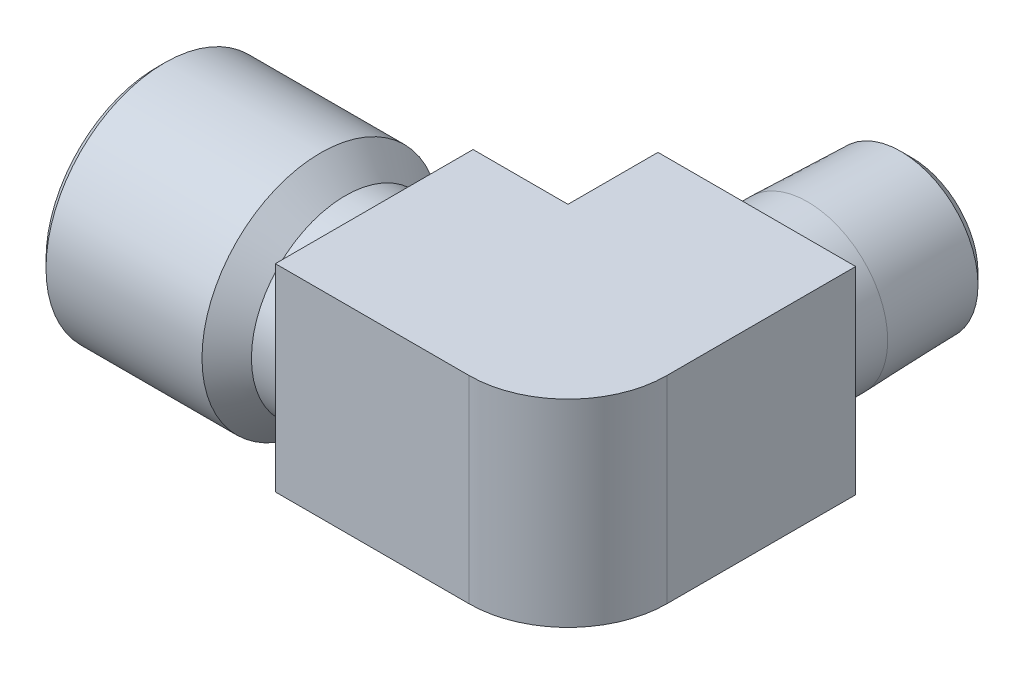
ISO-10303-21;
HEADER;
FILE_DESCRIPTION(('STEP AP214'),'2;1');
FILE_NAME('part.step','',(''),(''),'','','');
FILE_SCHEMA(('AUTOMOTIVE_DESIGN { 1 0 10303 214 1 1 1 1 }'));
ENDSEC;
DATA;
#1=APPLICATION_CONTEXT('core data for automotive mechanical design processes');
#2=APPLICATION_PROTOCOL_DEFINITION('international standard','automotive_design',2000,#1);
#3=PRODUCT_CONTEXT('',#1,'mechanical');
#4=PRODUCT('Part','Part','',(#3));
#5=PRODUCT_RELATED_PRODUCT_CATEGORY('part','',(#4));
#6=PRODUCT_DEFINITION_FORMATION('','',#4);
#7=PRODUCT_DEFINITION_CONTEXT('part definition',#1,'design');
#8=PRODUCT_DEFINITION('design','',#6,#7);
#9=PRODUCT_DEFINITION_SHAPE('','',#8);
#10=(LENGTH_UNIT() NAMED_UNIT(*) SI_UNIT(.MILLI.,.METRE.));
#11=(NAMED_UNIT(*) PLANE_ANGLE_UNIT() SI_UNIT($,.RADIAN.));
#12=(NAMED_UNIT(*) SI_UNIT($,.STERADIAN.) SOLID_ANGLE_UNIT());
#13=UNCERTAINTY_MEASURE_WITH_UNIT(LENGTH_MEASURE(1.E-05),#10,'distance_accuracy_value','');
#14=(GEOMETRIC_REPRESENTATION_CONTEXT(3) GLOBAL_UNCERTAINTY_ASSIGNED_CONTEXT((#13)) GLOBAL_UNIT_ASSIGNED_CONTEXT((#10,
#11,#12)) REPRESENTATION_CONTEXT('',''));
#15=CARTESIAN_POINT('',(0.,0.,0.));
#16=DIRECTION('',(0.,0.,1.));
#17=DIRECTION('',(1.,0.,0.));
#18=AXIS2_PLACEMENT_3D('',#15,#16,#17);
#19=CARTESIAN_POINT('',(0.75260200003413,0.,0.));
#20=DIRECTION('',(-1.,0.,0.));
#21=DIRECTION('',(0.,0.,1.));
#22=AXIS2_PLACEMENT_3D('',#19,#20,#21);
#23=CONICAL_SURFACE('',#22,4.36841899999862,0.0256563400042859);
#24=CARTESIAN_POINT('',(6.92404,0.,0.));
#25=DIRECTION('',(1.,0.,0.));
#26=DIRECTION('',(0.,0.,-1.));
#27=AXIS2_PLACEMENT_3D('',#24,#25,#26);
#28=CIRCLE('',#27,4.21004773765403);
#29=CARTESIAN_POINT('',(6.92404,0.,-4.21004773765403));
#30=VERTEX_POINT('',#29);
#31=EDGE_CURVE('E107',#30,#30,#28,.T.);
#32=ORIENTED_EDGE('',*,*,#31,.T.);
#33=EDGE_LOOP('',(#32));
#34=FACE_BOUND('',#33,.T.);
#35=CARTESIAN_POINT('',(0.75260200003413,0.,0.));
#36=DIRECTION('',(-1.,0.,0.));
#37=DIRECTION('',(0.,0.,-1.));
#38=AXIS2_PLACEMENT_3D('',#35,#36,#37);
#39=CIRCLE('',#38,4.36841900000218);
#40=CARTESIAN_POINT('',(0.75260200003413,0.,-4.36841900000218));
#41=VERTEX_POINT('',#40);
#42=EDGE_CURVE('E260',#41,#41,#39,.T.);
#43=ORIENTED_EDGE('',*,*,#42,.T.);
#44=EDGE_LOOP('',(#43));
#45=FACE_BOUND('',#44,.T.);
#46=ADVANCED_FACE('F16',(#34,#45),#23,.F.);
#47=CARTESIAN_POINT('',(0.,0.,0.));
#48=DIRECTION('',(-1.,0.,0.));
#49=DIRECTION('',(0.,0.,1.));
#50=AXIS2_PLACEMENT_3D('',#47,#48,#49);
#51=CONICAL_SURFACE('',#50,5.12102100003631,0.785398163397448);
#52=ORIENTED_EDGE('',*,*,#42,.F.);
#53=EDGE_LOOP('',(#52));
#54=FACE_BOUND('',#53,.T.);
#55=CARTESIAN_POINT('',(5.68431052990653E-11,0.,0.));
#56=DIRECTION('',(-1.,0.,0.));
#57=DIRECTION('',(0.,0.,1.));
#58=AXIS2_PLACEMENT_3D('',#55,#56,#57);
#59=CIRCLE('',#58,5.12102099997946);
#60=CARTESIAN_POINT('',(5.68427917373226E-11,0.,5.12102099997946));
#61=VERTEX_POINT('',#60);
#62=EDGE_CURVE('E106',#61,#61,#59,.F.);
#63=ORIENTED_EDGE('',*,*,#62,.F.);
#64=EDGE_LOOP('',(#63));
#65=FACE_BOUND('',#64,.T.);
#66=ADVANCED_FACE('F152',(#54,#65),#51,.F.);
#67=CARTESIAN_POINT('',(12.309476131173,0.,0.));
#68=DIRECTION('',(1.,0.,0.));
#69=DIRECTION('',(0.,0.,-1.));
#70=AXIS2_PLACEMENT_3D('',#67,#68,#69);
#71=CYLINDRICAL_SURFACE('',#70,4.21004773765403);
#72=CARTESIAN_POINT('',(24.618952262346,0.,0.));
#73=DIRECTION('',(1.,0.,0.));
#74=DIRECTION('',(0.,0.,-1.));
#75=AXIS2_PLACEMENT_3D('',#72,#73,#74);
#76=CIRCLE('',#75,4.21004773765403);
#77=CARTESIAN_POINT('',(24.618952262346,1.6103379858255,-3.88989890932055));
#78=VERTEX_POINT('',#77);
#79=CARTESIAN_POINT('',(24.618952262346,-1.6103379858255,-3.88989890932055));
#80=VERTEX_POINT('',#79);
#81=EDGE_CURVE('E100',#78,#80,#76,.T.);
#82=ORIENTED_EDGE('',*,*,#81,.T.);
#83=CARTESIAN_POINT('',(24.618952262346,-1.61033798582551,-3.88989890932055));
#84=CARTESIAN_POINT('',(24.5761517514441,-1.56256819439618,-3.90967618127494));
#85=CARTESIAN_POINT('',(24.5352002830716,-1.513042054605,-3.92914583396475));
#86=CARTESIAN_POINT('',(24.457190902885,-1.41059953878951,-3.96707653171256));
#87=CARTESIAN_POINT('',(24.4201354120485,-1.35768108725785,-3.98553694624573));
#88=CARTESIAN_POINT('',(24.3147625174257,-1.19345844350662,-4.03899017725357));
#89=CARTESIAN_POINT('',(24.2527585826209,-1.0772644043441,-4.07180748726187));
#90=CARTESIAN_POINT('',(24.1477610526028,-0.833823692695633,-4.12854310854132));
#91=CARTESIAN_POINT('',(24.1048474492068,-0.706533136893036,-4.15242390918881));
#92=CARTESIAN_POINT('',(24.0567402800899,-0.51085617269508,-4.17945916315892));
#93=CARTESIAN_POINT('',(24.0434250638162,-0.444970012755098,-4.18700054378774));
#94=CARTESIAN_POINT('',(24.0223202789761,-0.312058758352082,-4.19899464324768));
#95=CARTESIAN_POINT('',(24.0145265686562,-0.245034556276766,-4.2034496771321));
#96=CARTESIAN_POINT('',(24.0073730083506,-0.148204643409485,-4.20754257472755));
#97=CARTESIAN_POINT('',(24.005734516209,-0.118602103588787,-4.20848083121251));
#98=CARTESIAN_POINT('',(24.0035469895884,-0.0593370068334088,-4.20973426988068));
#99=CARTESIAN_POINT('',(24.0029983248078,-0.0296744329481424,-4.21004924062866));
#100=CARTESIAN_POINT('',(24.0030070204983,0.124361433988143,-4.21004143889571));
#101=CARTESIAN_POINT('',(24.012679837397,0.248931152478431,-4.20447681125012));
#102=CARTESIAN_POINT('',(24.0509037160742,0.494359432141786,-4.18274723913558));
#103=CARTESIAN_POINT('',(24.0795024201098,0.615207820051465,-4.16655554392996));
#104=CARTESIAN_POINT('',(24.1540278072954,0.849152791016968,-4.12522689514736));
#105=CARTESIAN_POINT('',(24.1998771148954,0.962281362445293,-4.10012991337379));
#106=CARTESIAN_POINT('',(24.3071315757284,1.17891600780244,-4.04316681679202));
#107=CARTESIAN_POINT('',(24.3685238131371,1.28242997410524,-4.01130632584042));
#108=CARTESIAN_POINT('',(24.4648940093036,1.42062652638749,-3.96335162938651));
#109=CARTESIAN_POINT('',(24.4941914275519,1.46000864469686,-3.9489958514298));
#110=CARTESIAN_POINT('',(24.5549561285686,1.53670679474741,-3.91978451241077));
#111=CARTESIAN_POINT('',(24.5864182350177,1.57402739521128,-3.9049301843173));
#112=CARTESIAN_POINT('',(24.618952262346,1.61033798582551,-3.88989890932055));
#113=B_SPLINE_CURVE_WITH_KNOTS('',3,(#83,#84,#85,#86,#87,#88,#89,#90,#91,#92,#93,#94,#95,#96,
#97,#98,#99,#100,#101,#102,#103,#104,#105,#106,#107,#108,#109,#110,#111,#112),.UNSPECIFIED.,.F.,
.F.,(4,2,2,2,2,2,2,2,2,2,2,2,2,2,4),(0.,0.201263229519651,0.40265079477016,0.807844262525907,
1.2147199274393,1.41738889367457,1.61990567384798,1.70887017747285,1.79786485507158,
2.17082920936377,2.54473601883561,2.9169853289542,3.28892631780561,3.44227866076124,
3.59527625436032),.UNSPECIFIED.);
#114=EDGE_CURVE('E98',#80,#78,#113,.T.);
#115=ORIENTED_EDGE('',*,*,#114,.T.);
#116=EDGE_LOOP('',(#82,#115));
#117=FACE_BOUND('',#116,.T.);
#118=ORIENTED_EDGE('',*,*,#31,.F.);
#119=EDGE_LOOP('',(#118));
#120=FACE_BOUND('',#119,.T.);
#121=ADVANCED_FACE('F101',(#117,#120),#71,.F.);
#122=CARTESIAN_POINT('',(24.618952262346,0.,0.));
#123=DIRECTION('',(0.536984179330145,0.60735203028803,0.585466909785804));
#124=DIRECTION('',(-0.815684433950088,0.550852229992023,0.176693873477095));
#125=AXIS2_PLACEMENT_3D('',#122,#123,#124);
#126=SPHERICAL_SURFACE('',#125,4.21004773765403);
#127=CARTESIAN_POINT('',(26.8796812916909,2.5569810410737,2.46484363901502));
#128=VERTEX_POINT('',#127);
#129=VERTEX_LOOP('',#128);
#130=FACE_BOUND('',#129,.T.);
#131=ORIENTED_EDGE('',*,*,#81,.F.);
#132=CARTESIAN_POINT('',(24.618952262346,1.61033798582551,-3.88989890932056));
#133=CARTESIAN_POINT('',(24.6485270757167,1.64334933733834,-3.87623380313933));
#134=CARTESIAN_POINT('',(24.6789215029794,1.67543776551692,-3.86211949137241));
#135=CARTESIAN_POINT('',(24.7416151543102,1.73808883208867,-3.83284573106307));
#136=CARTESIAN_POINT('',(24.77393350916,1.76862724170991,-3.81767538136084));
#137=CARTESIAN_POINT('',(24.8404676823379,1.82809071821353,-3.7862629709035));
#138=CARTESIAN_POINT('',(24.8747041404055,1.85698617457753,-3.77000861154253));
#139=CARTESIAN_POINT('',(24.945047087243,1.91308443271324,-3.73639068715219));
#140=CARTESIAN_POINT('',(24.9811748565549,1.94025232994554,-3.71901344093117));
#141=CARTESIAN_POINT('',(25.0552640632644,1.99280997358429,-3.68310600498566));
#142=CARTESIAN_POINT('',(25.0932466675497,2.01815958934484,-3.66456082369662));
#143=CARTESIAN_POINT('',(25.170975735198,2.06701967897712,-3.6262546768666));
#144=CARTESIAN_POINT('',(25.2107420506031,2.09048560772912,-3.60647722472803));
#145=CARTESIAN_POINT('',(25.2900360740434,2.13433702878545,-3.56666949668679));
#146=CARTESIAN_POINT('',(25.3295373400354,2.15479205078324,-3.54666313011146));
#147=CARTESIAN_POINT('',(25.4095027703919,2.1933964309605,-3.50584399425164));
#148=CARTESIAN_POINT('',(25.4499703982292,2.21153528265795,-3.4850280728591));
#149=CARTESIAN_POINT('',(25.5317775132782,2.24551150719192,-3.44257988733077));
#150=CARTESIAN_POINT('',(25.5731206959895,2.26133492097099,-3.4209435885885));
#151=CARTESIAN_POINT('',(25.6565975842089,2.29066791478491,-3.3768469408269));
#152=CARTESIAN_POINT('',(25.6987348165717,2.30416029070373,-3.35438183616871));
#153=CARTESIAN_POINT('',(25.7837072496985,2.32882800733405,-3.30861138280206));
#154=CARTESIAN_POINT('',(25.826545340716,2.33998333166772,-3.2853006343459));
#155=CARTESIAN_POINT('',(25.9128173465767,2.35998538778653,-3.23781281889241));
#156=CARTESIAN_POINT('',(25.9562531087129,2.36880982670266,-3.21362973575888));
#157=CARTESIAN_POINT('',(26.0412230628807,2.38371344966384,-3.16573542370415));
#158=CARTESIAN_POINT('',(26.0827545237279,2.3898986339105,-3.14205222415148));
#159=CARTESIAN_POINT('',(26.1656322913338,2.4000530285212,-3.09424213182298));
#160=CARTESIAN_POINT('',(26.2069787279527,2.40403010646415,-3.0701171348619));
#161=CARTESIAN_POINT('',(26.2894140509803,2.40982397894281,-3.02144021713197));
#162=CARTESIAN_POINT('',(26.3305033344505,2.41164679743815,-2.99688968255827));
#163=CARTESIAN_POINT('',(26.4123574839283,2.41318138085598,-2.94737833396462));
#164=CARTESIAN_POINT('',(26.4531228437028,2.41289748455466,-2.9224184687538));
#165=CARTESIAN_POINT('',(26.5342616788123,2.41027491640636,-2.87209752087325));
#166=CARTESIAN_POINT('',(26.5746356102778,2.40793902910608,-2.84673702763552));
#167=CARTESIAN_POINT('',(26.6549293438278,2.40125693180151,-2.79562852593905));
#168=CARTESIAN_POINT('',(26.6948494401972,2.396912110829,-2.76988079710717));
#169=CARTESIAN_POINT('',(26.776436049133,2.38600049303581,-2.71648848535337));
#170=CARTESIAN_POINT('',(26.8180716147198,2.37932067439389,-2.6888197303489));
#171=CARTESIAN_POINT('',(26.9003901707517,2.36394492712035,-2.63321427774376));
#172=CARTESIAN_POINT('',(26.9410775532735,2.35526218014923,-2.60528042975367));
#173=CARTESIAN_POINT('',(27.0214583801676,2.33594745436145,-2.54917571166813));
#174=CARTESIAN_POINT('',(27.0611562100233,2.3253270314813,-2.52100714459432));
#175=CARTESIAN_POINT('',(27.1395171388065,2.30221399124916,-2.46445146616171));
#176=CARTESIAN_POINT('',(27.1781845035166,2.28973126513126,-2.43606621913545));
#177=CARTESIAN_POINT('',(27.2544483659319,2.26296742414522,-2.37909109200152));
#178=CARTESIAN_POINT('',(27.2920488705651,2.24869457843695,-2.35050268919608));
#179=CARTESIAN_POINT('',(27.3661481314458,2.21841060943222,-2.2931390442262));
#180=CARTESIAN_POINT('',(27.402650493967,2.20240621321129,-2.26436490643521));
#181=CARTESIAN_POINT('',(27.4743926063774,2.16881728193375,-2.20671205507585));
#182=CARTESIAN_POINT('',(27.5096390387927,2.15124373433388,-2.17783524777513));
#183=CARTESIAN_POINT('',(27.5789423070928,2.11457576421128,-2.11988188774671));
#184=CARTESIAN_POINT('',(27.6130025554057,2.09548633201641,-2.09080625664765));
#185=CARTESIAN_POINT('',(27.6799136781381,2.05583572155454,-2.03246504662556));
#186=CARTESIAN_POINT('',(27.7127672827422,2.03527822115666,-2.0032000985954));
#187=CARTESIAN_POINT('',(27.7772454552048,1.99274794760888,-1.94447717963425));
#188=CARTESIAN_POINT('',(27.8088719425855,1.9707775405725,-1.91501960197991));
#189=CARTESIAN_POINT('',(27.8708778589165,1.92547094877017,-1.85590667066415));
#190=CARTESIAN_POINT('',(27.9012582591888,1.90213586356552,-1.82625149283202));
#191=CARTESIAN_POINT('',(27.9607543886966,1.85414625673302,-1.76673389793872));
#192=CARTESIAN_POINT('',(27.9898700012717,1.82949161385904,-1.73687146205403));
#193=CARTESIAN_POINT('',(28.0468188137542,1.77890514984038,-1.67692595211986));
#194=CARTESIAN_POINT('',(28.074650665864,1.75297204299119,-1.64684268296575));
#195=CARTESIAN_POINT('',(28.12901332594,1.69986726956966,-1.5864379344221));
#196=CARTESIAN_POINT('',(28.1555414088694,1.67269322027613,-1.55611609797746));
#197=CARTESIAN_POINT('',(28.2072762748821,1.61714167572603,-1.49521257457684));
#198=CARTESIAN_POINT('',(28.2324788069737,1.58876078077614,-1.46463037845543));
#199=CARTESIAN_POINT('',(28.2815399261695,1.53082761397679,-1.40318030672914));
#200=CARTESIAN_POINT('',(28.3053925853985,1.50127102016964,-1.37231177405958));
#201=CARTESIAN_POINT('',(28.3517281384196,1.44101541954874,-1.3102596369719));
#202=CARTESIAN_POINT('',(28.3742032747293,1.41031127670202,-1.2790752288292));
#203=CARTESIAN_POINT('',(28.4177540314195,1.34778863512071,-1.21635646951032));
#204=CARTESIAN_POINT('',(28.4388199108935,1.31596432080692,-1.18482115222846));
#205=CARTESIAN_POINT('',(28.4785825815848,1.2527099839394,-1.12282586370679));
#206=CARTESIAN_POINT('',(28.4973394726965,1.22131227114123,-1.092371444613));
#207=CARTESIAN_POINT('',(28.5334112166588,1.15769952778351,-1.03127149680152));
#208=CARTESIAN_POINT('',(28.5507222419247,1.12548260509424,-1.00062567813317));
#209=CARTESIAN_POINT('',(28.583889795745,1.06024556062244,-0.93911932739271));
#210=CARTESIAN_POINT('',(28.5997405331812,1.02722284694929,-0.908258422098955));
#211=CARTESIAN_POINT('',(28.629969701431,0.960385571460803,-0.846296262768356));
#212=CARTESIAN_POINT('',(28.6443402599011,0.926567843734952,-0.815194583453527));
#213=CARTESIAN_POINT('',(28.6715851837389,0.858151745993216,-0.752721844670119));
#214=CARTESIAN_POINT('',(28.6844494823522,0.823549785346504,-0.72135032772467));
#215=CARTESIAN_POINT('',(28.7086514224602,0.753576504325985,-0.658306375006725));
#216=CARTESIAN_POINT('',(28.7199766953809,0.718201332191991,-0.626633466618473));
#217=CARTESIAN_POINT('',(28.741063050412,0.646693914763992,-0.562953058676527));
#218=CARTESIAN_POINT('',(28.7508093609367,0.610557736987221,-0.530945084021046));
#219=CARTESIAN_POINT('',(28.7686927798259,0.537542387064126,-0.466559348021177));
#220=CARTESIAN_POINT('',(28.7768126195089,0.500659396775895,-0.434181120266676));
#221=CARTESIAN_POINT('',(28.79139025125,0.426167173304653,-0.369018795234282));
#222=CARTESIAN_POINT('',(28.7978281912087,0.388554445163474,-0.33623425204532));
#223=CARTESIAN_POINT('',(28.8089811509309,0.312623033841941,-0.270223090911711));
#224=CARTESIAN_POINT('',(28.8136736585782,0.274301399450621,-0.236996063550441));
#225=CARTESIAN_POINT('',(28.8212664619767,0.196977013514336,-0.170064306223376));
#226=CARTESIAN_POINT('',(28.8241415162615,0.157972086643659,-0.136359225052925));
#227=CARTESIAN_POINT('',(28.8280225346182,0.0793110542839043,-0.0684376351284863));
#228=CARTESIAN_POINT('',(28.8290004827771,0.0396537845667604,-0.0342208718998427));
#229=CARTESIAN_POINT('',(28.829,0.,0.));
#230=B_SPLINE_CURVE_WITH_KNOTS('',3,(#132,#133,#134,#135,#136,#137,#138,#139,#140,#141,#142,
#143,#144,#145,#146,#147,#148,#149,#150,#151,#152,#153,#154,#155,#156,#157,#158,#159,#160,#161,
#162,#163,#164,#165,#166,#167,#168,#169,#170,#171,#172,#173,#174,#175,#176,#177,#178,#179,#180,
#181,#182,#183,#184,#185,#186,#187,#188,#189,#190,#191,#192,#193,#194,#195,#196,#197,#198,#199,
#200,#201,#202,#203,#204,#205,#206,#207,#208,#209,#210,#211,#212,#213,#214,#215,#216,#217,#218,
#219,#220,#221,#222,#223,#224,#225,#226,#227,#228,#229),.UNSPECIFIED.,.F.,.F.,(4,2,2,2,2,2,2,2,
2,2,2,2,2,2,2,2,2,2,2,2,2,2,2,2,2,2,2,2,2,2,2,2,2,2,2,2,2,2,2,2,2,2,2,2,2,2,2,2,4),(0.,
0.139120471059706,0.279988461517851,0.42288754637322,0.568096169865131,0.715882716728663,
0.866500915627399,1.01275715053009,1.15965488572026,1.30740464468052,1.45620216025794,
1.60622623071863,1.75763706402475,1.90220853033337,2.04626152113631,2.18991073596198,
2.33326418766094,2.4764234090603,2.61948379393304,2.77073887639265,2.92102556998464,
3.07044365783287,3.21909467431791,3.36708270379462,3.51451515083208,3.66098595934398,
3.80699312308414,3.9526465342712,4.09806207843688,4.24336202947855,4.38867535424585,
4.53413792129366,4.67989261015968,4.82608931941995,4.97288487380734,5.12044283278945,
5.26893320511445,5.41168375929658,5.55480096518674,5.69846328498382,5.84285399977308,
5.98816043186745,6.13457312798304,6.28228501697387,6.43149055583882,6.58238487705293,
6.73516294901642,6.89001875965181,7.04714453104419),.UNSPECIFIED.);
#231=CARTESIAN_POINT('',(28.829,0.,0.));
#232=VERTEX_POINT('',#231);
#233=EDGE_CURVE('E114',#78,#232,#230,.T.);
#234=ORIENTED_EDGE('',*,*,#233,.T.);
#235=CARTESIAN_POINT('',(28.829,0.,0.));
#236=CARTESIAN_POINT('',(28.8290003800466,-0.0374098982197551,-0.0322843131207146));
#237=CARTESIAN_POINT('',(28.8281300276666,-0.0748096021188837,-0.0645803680993666));
#238=CARTESIAN_POINT('',(28.8246889637573,-0.148700427944332,-0.128465791891147));
#239=CARTESIAN_POINT('',(28.8221561413017,-0.185193411772913,-0.160055051852028));
#240=CARTESIAN_POINT('',(28.8155059723417,-0.257215919611324,-0.222509217240969));
#241=CARTESIAN_POINT('',(28.8114256255507,-0.292748620594817,-0.253374401578356));
#242=CARTESIAN_POINT('',(28.80179572492,-0.362802768672382,-0.314366248818205));
#243=CARTESIAN_POINT('',(28.7962822248883,-0.397328638726542,-0.344493527343218));
#244=CARTESIAN_POINT('',(28.783899668919,-0.465328362981203,-0.403998419154409));
#245=CARTESIAN_POINT('',(28.7770656864099,-0.498807811111005,-0.43337694006029));
#246=CARTESIAN_POINT('',(28.7621540387043,-0.564680337794393,-0.491375944855631));
#247=CARTESIAN_POINT('',(28.7541104318702,-0.597080113477468,-0.51999758527917));
#248=CARTESIAN_POINT('',(28.736889006024,-0.660765577677231,-0.576477482901519));
#249=CARTESIAN_POINT('',(28.7277442081369,-0.692058985875241,-0.604337091836766));
#250=CARTESIAN_POINT('',(28.7084280997664,-0.753508063764834,-0.659288739662797));
#251=CARTESIAN_POINT('',(28.6982887332254,-0.783672451640249,-0.686382313661051));
#252=CARTESIAN_POINT('',(28.6669057327036,-0.871265043000802,-0.765454633373071));
#253=CARTESIAN_POINT('',(28.6440413741297,-0.928195330334794,-0.817351979736838));
#254=CARTESIAN_POINT('',(28.5953031541066,-1.03731803724003,-0.918085053207952));
#255=CARTESIAN_POINT('',(28.5696587292005,-1.08960022824337,-0.9669346585299));
#256=CARTESIAN_POINT('',(28.5289172222598,-1.16555217909748,-1.03898358697894));
#257=CARTESIAN_POINT('',(28.5152913830887,-1.1899287522306,-1.06227839603307));
#258=CARTESIAN_POINT('',(28.4875920657163,-1.23750795479998,-1.10812763267357));
#259=CARTESIAN_POINT('',(28.473543931293,-1.26072394155006,-1.13068348627112));
#260=CARTESIAN_POINT('',(28.4394534204513,-1.31495859076309,-1.18383112020658));
#261=CARTESIAN_POINT('',(28.419069912232,-1.34578574343077,-1.21440025201274));
#262=CARTESIAN_POINT('',(28.3772714362955,-1.40593849458788,-1.27478741828702));
#263=CARTESIAN_POINT('',(28.3558858472432,-1.43528187645517,-1.30460809219046));
#264=CARTESIAN_POINT('',(28.3121952457364,-1.49246152751729,-1.36350050353203));
#265=CARTESIAN_POINT('',(28.2899183065682,-1.52031640064236,-1.39257499888984));
#266=CARTESIAN_POINT('',(28.2445534675533,-1.57452404198005,-1.4499727581043));
#267=CARTESIAN_POINT('',(28.2214923289799,-1.60089605261118,-1.47829900093325));
#268=CARTESIAN_POINT('',(28.1746635310175,-1.65214708317013,-1.53420110834118));
#269=CARTESIAN_POINT('',(28.1509213254885,-1.67704592643368,-1.56178012019174));
#270=CARTESIAN_POINT('',(28.1028307669705,-1.72536488181735,-1.61618972185843));
#271=CARTESIAN_POINT('',(28.078506568189,-1.74880531383454,-1.64302361459801));
#272=CARTESIAN_POINT('',(28.0293482236343,-1.79422595767645,-1.69594650260892));
#273=CARTESIAN_POINT('',(28.0045369447129,-1.81622691509412,-1.72203893233803));
#274=CARTESIAN_POINT('',(27.9544964165835,-1.85879099902619,-1.77348380221038));
#275=CARTESIAN_POINT('',(27.9292887625789,-1.87937522911393,-1.7988397863532));
#276=CARTESIAN_POINT('',(27.878543207203,-1.91913163283747,-1.84881804690697));
#277=CARTESIAN_POINT('',(27.8530256480491,-1.93832520651612,-1.87344395328956));
#278=CARTESIAN_POINT('',(27.8017437494058,-1.97532903299842,-1.92196964314371));
#279=CARTESIAN_POINT('',(27.7759985201074,-1.99316092598661,-1.94587311877926));
#280=CARTESIAN_POINT('',(27.7243405074593,-2.02747260808835,-1.99296284363204));
#281=CARTESIAN_POINT('',(27.6984456250638,-2.04397422812747,-2.01615282142697));
#282=CARTESIAN_POINT('',(27.6465633434966,-2.07565883809396,-2.06182552017551));
#283=CARTESIAN_POINT('',(27.6205926597032,-2.0908638017437,-2.08431198411527));
#284=CARTESIAN_POINT('',(27.5686296324653,-2.11998978071883,-2.12858934023482));
#285=CARTESIAN_POINT('',(27.5426528442251,-2.13393288596731,-2.15038395080461));
#286=CARTESIAN_POINT('',(27.4907445256274,-2.16057304273191,-2.19328847280978));
#287=CARTESIAN_POINT('',(27.4648274117089,-2.17329222227694,-2.21440209813066));
#288=CARTESIAN_POINT('',(27.4055563836588,-2.20104998371922,-2.26202548579533));
#289=CARTESIAN_POINT('',(27.3720407837695,-2.21581771515494,-2.28849261230487));
#290=CARTESIAN_POINT('',(27.304946121356,-2.2435440240142,-2.34059850149949));
#291=CARTESIAN_POINT('',(27.2713847528144,-2.25653531262212,-2.36624266138583));
#292=CARTESIAN_POINT('',(27.204287305461,-2.28077716580303,-2.41670575047159));
#293=CARTESIAN_POINT('',(27.1707671456155,-2.29205992409297,-2.44153037412629));
#294=CARTESIAN_POINT('',(27.1038350354536,-2.31295284401689,-2.49036002024261));
#295=CARTESIAN_POINT('',(27.0704372998415,-2.32259465875464,-2.51437098335598));
#296=CARTESIAN_POINT('',(27.0038267386503,-2.34027311242423,-2.56158208082287));
#297=CARTESIAN_POINT('',(26.9706265054288,-2.34834084855319,-2.58478833470164));
#298=CARTESIAN_POINT('',(26.9044794076462,-2.36294812982687,-2.63039412803889));
#299=CARTESIAN_POINT('',(26.8715436427881,-2.36951796828917,-2.65280007176865));
#300=CARTESIAN_POINT('',(26.8014693509934,-2.38197770756396,-2.69987502108066));
#301=CARTESIAN_POINT('',(26.7642795115387,-2.38770486597924,-2.72451102674911));
#302=CARTESIAN_POINT('',(26.690403116064,-2.39729487743873,-2.77281277799553));
#303=CARTESIAN_POINT('',(26.6537279457161,-2.40120158756941,-2.79648723809255));
#304=CARTESIAN_POINT('',(26.5809538179679,-2.40726108426151,-2.84288041301503));
#305=CARTESIAN_POINT('',(26.5448640976915,-2.40945615447388,-2.86560808891391));
#306=CARTESIAN_POINT('',(26.4733280415803,-2.41218957117401,-2.91013143541041));
#307=CARTESIAN_POINT('',(26.4378888565973,-2.41276885238961,-2.93193607634527));
#308=CARTESIAN_POINT('',(26.3677116077835,-2.41236685850359,-2.97463822666524));
#309=CARTESIAN_POINT('',(26.3329787642923,-2.4114250763511,-2.99554467928726));
#310=CARTESIAN_POINT('',(26.2642644070838,-2.40807133583301,-3.03647878462028));
#311=CARTESIAN_POINT('',(26.2302862928649,-2.40569743969393,-3.05651525719028));
#312=CARTESIAN_POINT('',(26.1631227129058,-2.39956687681167,-3.09573921863578));
#313=CARTESIAN_POINT('',(26.1299389728797,-2.39584676335589,-3.11493535618126));
#314=CARTESIAN_POINT('',(26.0644023986686,-2.38709801594978,-3.15251461594859));
#315=CARTESIAN_POINT('',(26.032049621971,-2.38210458234833,-3.17090604980806));
#316=CARTESIAN_POINT('',(25.9604651829193,-2.36954844598766,-3.21125566184245));
#317=CARTESIAN_POINT('',(25.9212444076568,-2.36166451602827,-3.23313404089147));
#318=CARTESIAN_POINT('',(25.8439802945309,-2.34413454811901,-3.27579191566782));
#319=CARTESIAN_POINT('',(25.8059329128843,-2.33453979609876,-3.29658518995629));
#320=CARTESIAN_POINT('',(25.7310382700422,-2.31369581982233,-3.33713226063391));
#321=CARTESIAN_POINT('',(25.6941848364045,-2.30249410839768,-3.35689904805206));
#322=CARTESIAN_POINT('',(25.6216840448078,-2.2785370877901,-3.39545063098167));
#323=CARTESIAN_POINT('',(25.5860288577766,-2.26582510035902,-3.41424760122169));
#324=CARTESIAN_POINT('',(25.5159186039082,-2.23893062557628,-3.45092016576554));
#325=CARTESIAN_POINT('',(25.4814544662622,-2.22478704594584,-3.46880695061596));
#326=CARTESIAN_POINT('',(25.4137055391504,-2.19509485742962,-3.50372176929316));
#327=CARTESIAN_POINT('',(25.3804109934369,-2.17958043680403,-3.52075985380745));
#328=CARTESIAN_POINT('',(25.3311168983403,-2.15519026133974,-3.54582529499351));
#329=CARTESIAN_POINT('',(25.3149044533357,-2.14693519903397,-3.55404280451221));
#330=CARTESIAN_POINT('',(25.2827612926425,-2.1300930753018,-3.57028778879125));
#331=CARTESIAN_POINT('',(25.2668293558856,-2.12150932350972,-3.57831627305204));
#332=CARTESIAN_POINT('',(25.2338289310947,-2.10324654216331,-3.59489090332521));
#333=CARTESIAN_POINT('',(25.2167729503707,-2.09353512098565,-3.60342628417135));
#334=CARTESIAN_POINT('',(25.1829905481841,-2.0737622350461,-3.62026559180412));
#335=CARTESIAN_POINT('',(25.1662625456756,-2.06370463474565,-3.62857089936224));
#336=CARTESIAN_POINT('',(25.1085842830429,-2.02807450953403,-3.65710480102757));
#337=CARTESIAN_POINT('',(25.0681162007169,-2.00139549371035,-3.67694304561487));
#338=CARTESIAN_POINT('',(24.9890350107126,-1.9457875139416,-3.71539010542125));
#339=CARTESIAN_POINT('',(24.950404939347,-1.91689118996512,-3.73401127566672));
#340=CARTESIAN_POINT('',(24.8898196884889,-1.86874630671859,-3.76296125841198));
#341=CARTESIAN_POINT('',(24.8673953949848,-1.85028099991513,-3.7736183277186));
#342=CARTESIAN_POINT('',(24.8233883626149,-1.8126848943928,-3.79444544058755));
#343=CARTESIAN_POINT('',(24.8017988568574,-1.79356437635154,-3.80461971628255));
#344=CARTESIAN_POINT('',(24.7524009941997,-1.74816631479233,-3.82782454024998));
#345=CARTESIAN_POINT('',(24.7248261690064,-1.721565034192,-3.84072109364004));
#346=CARTESIAN_POINT('',(24.6709442251196,-1.66698631350224,-3.86582196750487));
#347=CARTESIAN_POINT('',(24.6446332923808,-1.63901360593924,-3.87802839327721));
#348=CARTESIAN_POINT('',(24.618952262346,-1.6103379858255,-3.88989890932055));
#349=B_SPLINE_CURVE_WITH_KNOTS('',3,(#235,#236,#237,#238,#239,#240,#241,#242,#243,#244,#245,
#246,#247,#248,#249,#250,#251,#252,#253,#254,#255,#256,#257,#258,#259,#260,#261,#262,#263,#264,
#265,#266,#267,#268,#269,#270,#271,#272,#273,#274,#275,#276,#277,#278,#279,#280,#281,#282,#283,
#284,#285,#286,#287,#288,#289,#290,#291,#292,#293,#294,#295,#296,#297,#298,#299,#300,#301,#302,
#303,#304,#305,#306,#307,#308,#309,#310,#311,#312,#313,#314,#315,#316,#317,#318,#319,#320,#321,
#322,#323,#324,#325,#326,#327,#328,#329,#330,#331,#332,#333,#334,#335,#336,#337,#338,#339,#340,
#341,#342,#343,#344,#345,#346,#347,#348),.UNSPECIFIED.,.F.,.F.,(4,2,2,2,2,2,2,2,2,2,2,2,2,2,2,2,
2,2,2,2,2,2,2,2,2,2,2,2,2,2,2,2,2,2,2,2,2,2,2,2,2,2,2,2,2,2,2,2,2,2,2,2,2,2,2,2,4),(0.,
0.148235213657188,0.29320414385708,0.434905667529481,0.573339202385632,0.708504719702799,
0.840402752774602,0.969034402123149,1.09440133859785,1.33532515404592,1.56322805184254,
1.67231664429837,1.77816273026738,1.92201437395027,2.06294271953771,2.20096340510544,
2.33609301286499,2.46834897396673,2.59774948227537,2.7243134192304,2.84806029171123,
2.96901018465261,3.08718373000494,3.20260209350946,3.31528698066654,3.4252606632167,
3.53254602743494,3.66807394107882,3.80061352903041,3.93021617086036,4.05693255156233,
4.18081273846523,4.30190633223092,4.43679613596299,4.56824269876637,4.69632900776749,
4.8211395283686,4.94276123054279,5.0612847565366,5.17680571926493,5.28942611882243,
5.42616893591112,5.55934752836598,5.68918703018435,5.815936287911,5.93987185867302,
6.06130170365927,6.12118625638583,6.18057563876702,6.24477714471966,6.30840973525094,
6.465432479765,6.62047377955685,6.71328112558629,6.80500544229529,6.92623530696371,
7.04707281590139),.UNSPECIFIED.);
#350=EDGE_CURVE('E112',#232,#80,#349,.T.);
#351=ORIENTED_EDGE('',*,*,#350,.T.);
#352=EDGE_LOOP('',(#131,#234,#351));
#353=FACE_BOUND('',#352,.T.);
#354=ADVANCED_FACE('F117',(#130,#353),#126,.F.);
#355=CARTESIAN_POINT('',(0.,0.,-3.81));
#356=DIRECTION('',(-1.,0.,0.));
#357=DIRECTION('',(0.,0.,1.));
#358=AXIS2_PLACEMENT_3D('',#355,#356,#357);
#359=PLANE('',#358);
#360=ORIENTED_EDGE('',*,*,#62,.T.);
#361=EDGE_LOOP('',(#360));
#362=FACE_BOUND('',#361,.T.);
#363=CARTESIAN_POINT('',(0.,0.,0.));
#364=DIRECTION('',(1.,0.,0.));
#365=DIRECTION('',(0.,0.,-1.));
#366=AXIS2_PLACEMENT_3D('',#363,#364,#365);
#367=CIRCLE('',#366,7.112);
#368=CARTESIAN_POINT('',(0.,0.,-7.112));
#369=VERTEX_POINT('',#368);
#370=EDGE_CURVE('E240',#369,#369,#367,.F.);
#371=ORIENTED_EDGE('',*,*,#370,.T.);
#372=EDGE_LOOP('',(#371));
#373=FACE_BOUND('',#372,.T.);
#374=ADVANCED_FACE('F134',(#362,#373),#359,.T.);
#375=CARTESIAN_POINT('',(26.416,0.,-17.11452));
#376=DIRECTION('',(0.,0.,-1.));
#377=DIRECTION('',(-1.,0.,0.));
#378=AXIS2_PLACEMENT_3D('',#375,#376,#377);
#379=CYLINDRICAL_SURFACE('',#378,2.413);
#380=CARTESIAN_POINT('',(26.416,0.,-22.098));
#381=DIRECTION('',(0.,0.,-1.));
#382=DIRECTION('',(-1.,0.,0.));
#383=AXIS2_PLACEMENT_3D('',#380,#381,#382);
#384=CIRCLE('',#383,2.413);
#385=CARTESIAN_POINT('',(24.003,0.,-22.098));
#386=VERTEX_POINT('',#385);
#387=EDGE_CURVE('E238',#386,#386,#384,.F.);
#388=ORIENTED_EDGE('',*,*,#387,.F.);
#389=EDGE_LOOP('',(#388));
#390=FACE_BOUND('',#389,.T.);
#391=ORIENTED_EDGE('',*,*,#350,.F.);
#392=ORIENTED_EDGE('',*,*,#233,.F.);
#393=ORIENTED_EDGE('',*,*,#114,.F.);
#394=EDGE_LOOP('',(#391,#392,#393));
#395=FACE_BOUND('',#394,.T.);
#396=ADVANCED_FACE('F111',(#390,#395),#379,.F.);
#397=CARTESIAN_POINT('',(0.,0.,0.));
#398=DIRECTION('',(1.,0.,0.));
#399=DIRECTION('',(0.,0.,-1.));
#400=AXIS2_PLACEMENT_3D('',#397,#398,#399);
#401=CONICAL_SURFACE('',#400,7.112,0.785398163397448);
#402=ORIENTED_EDGE('',*,*,#370,.F.);
#403=EDGE_LOOP('',(#402));
#404=FACE_BOUND('',#403,.T.);
#405=CARTESIAN_POINT('',(0.508,0.,0.));
#406=DIRECTION('',(-1.,0.,0.));
#407=DIRECTION('',(0.,0.,1.));
#408=AXIS2_PLACEMENT_3D('',#405,#406,#407);
#409=CIRCLE('',#408,7.62);
#410=CARTESIAN_POINT('',(0.507999999999999,0.,7.62));
#411=VERTEX_POINT('',#410);
#412=EDGE_CURVE('E239',#411,#411,#409,.F.);
#413=ORIENTED_EDGE('',*,*,#412,.F.);
#414=EDGE_LOOP('',(#413));
#415=FACE_BOUND('',#414,.T.);
#416=ADVANCED_FACE('F133',(#404,#415),#401,.T.);
#417=CARTESIAN_POINT('',(23.9486001989067,0.,-22.098));
#418=DIRECTION('',(0.,0.,-1.));
#419=DIRECTION('',(-1.,0.,0.));
#420=AXIS2_PLACEMENT_3D('',#417,#418,#419);
#421=PLANE('',#420);
#422=CARTESIAN_POINT('',(26.416,0.,-22.0980000000281));
#423=DIRECTION('',(0.,0.,1.));
#424=DIRECTION('',(1.,0.,0.));
#425=AXIS2_PLACEMENT_3D('',#422,#423,#424);
#426=CIRCLE('',#425,4.24052999996394);
#427=CARTESIAN_POINT('',(30.6565299999639,0.,-22.0980000000281));
#428=VERTEX_POINT('',#427);
#429=EDGE_CURVE('E235',#428,#428,#426,.F.);
#430=ORIENTED_EDGE('',*,*,#429,.T.);
#431=EDGE_LOOP('',(#430));
#432=FACE_BOUND('',#431,.T.);
#433=ORIENTED_EDGE('',*,*,#387,.T.);
#434=EDGE_LOOP('',(#433));
#435=FACE_BOUND('',#434,.T.);
#436=ADVANCED_FACE('F224',(#432,#435),#421,.T.);
#437=CARTESIAN_POINT('',(6.0579,0.,0.));
#438=DIRECTION('',(-1.,0.,0.));
#439=DIRECTION('',(0.,0.,1.));
#440=AXIS2_PLACEMENT_3D('',#437,#438,#439);
#441=CYLINDRICAL_SURFACE('',#440,7.62);
#442=CARTESIAN_POINT('',(10.5283000000327,0.,0.));
#443=DIRECTION('',(-1.,0.,0.));
#444=DIRECTION('',(0.,0.,-1.));
#445=AXIS2_PLACEMENT_3D('',#442,#443,#444);
#446=CIRCLE('',#445,7.62000000003127);
#447=CARTESIAN_POINT('',(10.5283000000327,0.,-7.62000000003127));
#448=VERTEX_POINT('',#447);
#449=EDGE_CURVE('E247',#448,#448,#446,.T.);
#450=ORIENTED_EDGE('',*,*,#449,.T.);
#451=EDGE_LOOP('',(#450));
#452=FACE_BOUND('',#451,.T.);
#453=ORIENTED_EDGE('',*,*,#412,.T.);
#454=EDGE_LOOP('',(#453));
#455=FACE_BOUND('',#454,.T.);
#456=ADVANCED_FACE('F221',(#452,#455),#441,.T.);
#457=CARTESIAN_POINT('',(26.416,0.,-22.0980000001418));
#458=DIRECTION('',(0.,0.,1.));
#459=DIRECTION('',(1.,0.,0.));
#460=AXIS2_PLACEMENT_3D('',#457,#458,#459);
#461=CONICAL_SURFACE('',#460,4.24052999985025,0.785398163397448);
#462=CARTESIAN_POINT('',(26.416,0.,-21.3814196002886));
#463=DIRECTION('',(0.,0.,1.));
#464=DIRECTION('',(-1.,0.,0.));
#465=AXIS2_PLACEMENT_3D('',#462,#463,#464);
#466=CIRCLE('',#465,4.95711039971592);
#467=CARTESIAN_POINT('',(21.4588896002841,0.,-21.3814196002886));
#468=VERTEX_POINT('',#467);
#469=EDGE_CURVE('E351',#468,#468,#466,.T.);
#470=ORIENTED_EDGE('',*,*,#469,.F.);
#471=EDGE_LOOP('',(#470));
#472=FACE_BOUND('',#471,.T.);
#473=ORIENTED_EDGE('',*,*,#429,.F.);
#474=EDGE_LOOP('',(#473));
#475=FACE_BOUND('',#474,.T.);
#476=ADVANCED_FACE('F217',(#472,#475),#461,.T.);
#477=CARTESIAN_POINT('',(12.1158000001174,0.,0.));
#478=DIRECTION('',(-1.,0.,0.));
#479=DIRECTION('',(0.,-1.,0.));
#480=AXIS2_PLACEMENT_3D('',#477,#478,#479);
#481=CONICAL_SURFACE('',#480,6.03249999994659,0.785398163397448);
#482=CARTESIAN_POINT('',(12.1158,0.,0.));
#483=DIRECTION('',(-1.,0.,0.));
#484=DIRECTION('',(0.,0.,1.));
#485=AXIS2_PLACEMENT_3D('',#482,#483,#484);
#486=CIRCLE('',#485,6.0325);
#487=CARTESIAN_POINT('',(12.1158,0.,6.0325));
#488=VERTEX_POINT('',#487);
#489=EDGE_CURVE('E348',#488,#488,#486,.F.);
#490=ORIENTED_EDGE('',*,*,#489,.F.);
#491=EDGE_LOOP('',(#490));
#492=FACE_BOUND('',#491,.T.);
#493=ORIENTED_EDGE('',*,*,#449,.F.);
#494=EDGE_LOOP('',(#493));
#495=FACE_BOUND('',#494,.T.);
#496=ADVANCED_FACE('F213',(#492,#495),#481,.T.);
#497=CARTESIAN_POINT('',(26.416,0.,-15.3949400001352));
#498=DIRECTION('',(0.,0.,1.));
#499=DIRECTION('',(1.,0.,0.));
#500=AXIS2_PLACEMENT_3D('',#497,#498,#499);
#501=CONICAL_SURFACE('',#500,5.14349999999797,0.0311250383217235);
#502=CARTESIAN_POINT('',(26.416,0.,-15.39494));
#503=DIRECTION('',(0.,0.,1.));
#504=DIRECTION('',(1.,0.,0.));
#505=AXIS2_PLACEMENT_3D('',#502,#503,#504);
#506=CIRCLE('',#505,5.1435);
#507=CARTESIAN_POINT('',(31.5595,0.,-15.39494));
#508=VERTEX_POINT('',#507);
#509=EDGE_CURVE('E331',#508,#508,#506,.T.);
#510=ORIENTED_EDGE('',*,*,#509,.F.);
#511=EDGE_LOOP('',(#510));
#512=FACE_BOUND('',#511,.T.);
#513=ORIENTED_EDGE('',*,*,#469,.T.);
#514=EDGE_LOOP('',(#513));
#515=FACE_BOUND('',#514,.T.);
#516=ADVANCED_FACE('F209',(#512,#515),#501,.T.);
#517=CARTESIAN_POINT('',(13.0429,0.,0.));
#518=DIRECTION('',(-1.,0.,0.));
#519=DIRECTION('',(0.,0.,1.));
#520=AXIS2_PLACEMENT_3D('',#517,#518,#519);
#521=CYLINDRICAL_SURFACE('',#520,6.0325);
#522=CARTESIAN_POINT('',(13.97,0.,0.));
#523=DIRECTION('',(-1.,0.,0.));
#524=DIRECTION('',(0.,0.,1.));
#525=AXIS2_PLACEMENT_3D('',#522,#523,#524);
#526=CIRCLE('',#525,6.0325);
#527=CARTESIAN_POINT('',(13.97,0.,6.0325));
#528=VERTEX_POINT('',#527);
#529=EDGE_CURVE('E248',#528,#528,#526,.F.);
#530=ORIENTED_EDGE('',*,*,#529,.F.);
#531=EDGE_LOOP('',(#530));
#532=FACE_BOUND('',#531,.T.);
#533=ORIENTED_EDGE('',*,*,#489,.T.);
#534=EDGE_LOOP('',(#533));
#535=FACE_BOUND('',#534,.T.);
#536=ADVANCED_FACE('F205',(#532,#535),#521,.T.);
#537=CARTESIAN_POINT('',(26.416,0.,-13.76299));
#538=DIRECTION('',(0.,0.,1.));
#539=DIRECTION('',(1.,0.,0.));
#540=AXIS2_PLACEMENT_3D('',#537,#538,#539);
#541=CYLINDRICAL_SURFACE('',#540,5.1435);
#542=CARTESIAN_POINT('',(26.416,0.,-12.13104));
#543=DIRECTION('',(0.,0.,1.));
#544=DIRECTION('',(1.,0.,0.));
#545=AXIS2_PLACEMENT_3D('',#542,#543,#544);
#546=CIRCLE('',#545,5.1435);
#547=CARTESIAN_POINT('',(31.5595,0.,-12.13104));
#548=VERTEX_POINT('',#547);
#549=EDGE_CURVE('E252',#548,#548,#546,.T.);
#550=ORIENTED_EDGE('',*,*,#549,.F.);
#551=EDGE_LOOP('',(#550));
#552=FACE_BOUND('',#551,.T.);
#553=ORIENTED_EDGE('',*,*,#509,.T.);
#554=EDGE_LOOP('',(#553));
#555=FACE_BOUND('',#554,.T.);
#556=ADVANCED_FACE('F202',(#552,#555),#541,.T.);
#557=CARTESIAN_POINT('',(13.97,6.35,6.35));
#558=DIRECTION('',(0.,1.,0.));
#559=DIRECTION('',(0.,0.,1.));
#560=AXIS2_PLACEMENT_3D('',#557,#558,#559);
#561=PLANE('',#560);
#562=DIRECTION('',(1.,0.,0.));
#563=VECTOR('',#562,1.);
#564=CARTESIAN_POINT('',(13.97,6.35,6.35));
#565=LINE('',#564,#563);
#566=CARTESIAN_POINT('',(26.416,6.35,6.35));
#567=VERTEX_POINT('',#566);
#568=CARTESIAN_POINT('',(13.97,6.35,6.35));
#569=VERTEX_POINT('',#568);
#570=EDGE_CURVE('E58',#567,#569,#565,.F.);
#571=ORIENTED_EDGE('',*,*,#570,.F.);
#572=CARTESIAN_POINT('',(26.416,6.35,0.));
#573=DIRECTION('',(0.,-1.,0.));
#574=DIRECTION('',(0.,0.,-1.));
#575=AXIS2_PLACEMENT_3D('',#572,#573,#574);
#576=CIRCLE('',#575,6.35);
#577=CARTESIAN_POINT('',(32.766,6.35,0.));
#578=VERTEX_POINT('',#577);
#579=EDGE_CURVE('E256',#578,#567,#576,.T.);
#580=ORIENTED_EDGE('',*,*,#579,.F.);
#581=DIRECTION('',(0.,0.,-1.));
#582=VECTOR('',#581,1.);
#583=CARTESIAN_POINT('',(32.766,6.35,0.));
#584=LINE('',#583,#582);
#585=CARTESIAN_POINT('',(32.766,6.35,-12.13104));
#586=VERTEX_POINT('',#585);
#587=EDGE_CURVE('E51',#586,#578,#584,.F.);
#588=ORIENTED_EDGE('',*,*,#587,.F.);
#589=DIRECTION('',(-1.,0.,0.));
#590=VECTOR('',#589,1.);
#591=CARTESIAN_POINT('',(29.591,6.35,-12.13104));
#592=LINE('',#591,#590);
#593=CARTESIAN_POINT('',(20.066,6.35,-12.13104));
#594=VERTEX_POINT('',#593);
#595=EDGE_CURVE('E66',#594,#586,#592,.F.);
#596=ORIENTED_EDGE('',*,*,#595,.F.);
#597=DIRECTION('',(0.,0.,1.));
#598=VECTOR('',#597,1.);
#599=CARTESIAN_POINT('',(20.066,6.35,0.));
#600=LINE('',#599,#598);
#601=CARTESIAN_POINT('',(20.066,6.35,-6.35));
#602=VERTEX_POINT('',#601);
#603=EDGE_CURVE('E295',#602,#594,#600,.F.);
#604=ORIENTED_EDGE('',*,*,#603,.F.);
#605=DIRECTION('',(-1.,0.,0.));
#606=VECTOR('',#605,1.);
#607=CARTESIAN_POINT('',(13.97,6.35,-6.35));
#608=LINE('',#607,#606);
#609=CARTESIAN_POINT('',(13.97,6.35,-6.35));
#610=VERTEX_POINT('',#609);
#611=EDGE_CURVE('E306',#610,#602,#608,.F.);
#612=ORIENTED_EDGE('',*,*,#611,.F.);
#613=DIRECTION('',(0.,0.,1.));
#614=VECTOR('',#613,1.);
#615=CARTESIAN_POINT('',(13.97,6.35,-3.175));
#616=LINE('',#615,#614);
#617=EDGE_CURVE('E316',#569,#610,#616,.F.);
#618=ORIENTED_EDGE('',*,*,#617,.F.);
#619=EDGE_LOOP('',(#571,#580,#588,#596,#604,#612,#618));
#620=FACE_BOUND('',#619,.T.);
#621=ADVANCED_FACE('F198',(#620),#561,.T.);
#622=CARTESIAN_POINT('',(13.97,-6.35,6.35));
#623=DIRECTION('',(0.,0.,1.));
#624=DIRECTION('',(0.,-1.,0.));
#625=AXIS2_PLACEMENT_3D('',#622,#623,#624);
#626=PLANE('',#625);
#627=DIRECTION('',(0.,-1.,0.));
#628=VECTOR('',#627,1.);
#629=CARTESIAN_POINT('',(26.416,0.,6.35));
#630=LINE('',#629,#628);
#631=CARTESIAN_POINT('',(26.416,-6.35,6.35));
#632=VERTEX_POINT('',#631);
#633=EDGE_CURVE('E279',#567,#632,#630,.T.);
#634=ORIENTED_EDGE('',*,*,#633,.F.);
#635=ORIENTED_EDGE('',*,*,#570,.T.);
#636=DIRECTION('',(0.,1.,0.));
#637=VECTOR('',#636,1.);
#638=CARTESIAN_POINT('',(13.97,0.,6.35));
#639=LINE('',#638,#637);
#640=CARTESIAN_POINT('',(13.97,-6.35,6.35));
#641=VERTEX_POINT('',#640);
#642=EDGE_CURVE('E251',#641,#569,#639,.T.);
#643=ORIENTED_EDGE('',*,*,#642,.F.);
#644=DIRECTION('',(1.,0.,0.));
#645=VECTOR('',#644,1.);
#646=CARTESIAN_POINT('',(13.97,-6.35,6.35));
#647=LINE('',#646,#645);
#648=EDGE_CURVE('E258',#632,#641,#647,.F.);
#649=ORIENTED_EDGE('',*,*,#648,.F.);
#650=EDGE_LOOP('',(#634,#635,#643,#649));
#651=FACE_BOUND('',#650,.T.);
#652=ADVANCED_FACE('F194',(#651),#626,.T.);
#653=CARTESIAN_POINT('',(13.97,0.,-3.175));
#654=DIRECTION('',(-1.,0.,0.));
#655=DIRECTION('',(0.,0.,1.));
#656=AXIS2_PLACEMENT_3D('',#653,#654,#655);
#657=PLANE('',#656);
#658=ORIENTED_EDGE('',*,*,#617,.T.);
#659=DIRECTION('',(0.,1.,0.));
#660=VECTOR('',#659,1.);
#661=CARTESIAN_POINT('',(13.97,6.35,-6.35));
#662=LINE('',#661,#660);
#663=CARTESIAN_POINT('',(13.97,-6.35,-6.35));
#664=VERTEX_POINT('',#663);
#665=EDGE_CURVE('E313',#664,#610,#662,.T.);
#666=ORIENTED_EDGE('',*,*,#665,.F.);
#667=DIRECTION('',(0.,0.,1.));
#668=VECTOR('',#667,1.);
#669=CARTESIAN_POINT('',(13.97,-6.35,-6.35));
#670=LINE('',#669,#668);
#671=EDGE_CURVE('E277',#641,#664,#670,.F.);
#672=ORIENTED_EDGE('',*,*,#671,.F.);
#673=ORIENTED_EDGE('',*,*,#642,.T.);
#674=EDGE_LOOP('',(#658,#666,#672,#673));
#675=FACE_BOUND('',#674,.T.);
#676=ORIENTED_EDGE('',*,*,#529,.T.);
#677=EDGE_LOOP('',(#676));
#678=FACE_BOUND('',#677,.T.);
#679=ADVANCED_FACE('F190',(#675,#678),#657,.T.);
#680=CARTESIAN_POINT('',(13.97,6.35,-6.35));
#681=DIRECTION('',(0.,0.,-1.));
#682=DIRECTION('',(-1.,0.,0.));
#683=AXIS2_PLACEMENT_3D('',#680,#681,#682);
#684=PLANE('',#683);
#685=ORIENTED_EDGE('',*,*,#665,.T.);
#686=ORIENTED_EDGE('',*,*,#611,.T.);
#687=DIRECTION('',(0.,1.,0.));
#688=VECTOR('',#687,1.);
#689=CARTESIAN_POINT('',(20.066,6.35,-6.35));
#690=LINE('',#689,#688);
#691=CARTESIAN_POINT('',(20.066,-6.35,-6.35));
#692=VERTEX_POINT('',#691);
#693=EDGE_CURVE('E303',#692,#602,#690,.T.);
#694=ORIENTED_EDGE('',*,*,#693,.F.);
#695=DIRECTION('',(1.,0.,0.));
#696=VECTOR('',#695,1.);
#697=CARTESIAN_POINT('',(13.97,-6.35,-6.35));
#698=LINE('',#697,#696);
#699=EDGE_CURVE('E300',#664,#692,#698,.T.);
#700=ORIENTED_EDGE('',*,*,#699,.F.);
#701=EDGE_LOOP('',(#685,#686,#694,#700));
#702=FACE_BOUND('',#701,.T.);
#703=ADVANCED_FACE('F186',(#702),#684,.T.);
#704=CARTESIAN_POINT('',(20.066,6.35,0.));
#705=DIRECTION('',(-1.,0.,0.));
#706=DIRECTION('',(0.,0.,1.));
#707=AXIS2_PLACEMENT_3D('',#704,#705,#706);
#708=PLANE('',#707);
#709=DIRECTION('',(0.,1.,0.));
#710=VECTOR('',#709,1.);
#711=CARTESIAN_POINT('',(20.066,0.,-12.13104));
#712=LINE('',#711,#710);
#713=CARTESIAN_POINT('',(20.066,-6.35,-12.13104));
#714=VERTEX_POINT('',#713);
#715=EDGE_CURVE('E293',#714,#594,#712,.T.);
#716=ORIENTED_EDGE('',*,*,#715,.F.);
#717=DIRECTION('',(0.,0.,1.));
#718=VECTOR('',#717,1.);
#719=CARTESIAN_POINT('',(20.066,-6.35,-6.35));
#720=LINE('',#719,#718);
#721=EDGE_CURVE('E290',#692,#714,#720,.F.);
#722=ORIENTED_EDGE('',*,*,#721,.F.);
#723=ORIENTED_EDGE('',*,*,#693,.T.);
#724=ORIENTED_EDGE('',*,*,#603,.T.);
#725=EDGE_LOOP('',(#716,#722,#723,#724));
#726=FACE_BOUND('',#725,.T.);
#727=ADVANCED_FACE('F182',(#726),#708,.T.);
#728=CARTESIAN_POINT('',(29.591,0.,-12.13104));
#729=DIRECTION('',(0.,0.,-1.));
#730=DIRECTION('',(-1.,0.,0.));
#731=AXIS2_PLACEMENT_3D('',#728,#729,#730);
#732=PLANE('',#731);
#733=ORIENTED_EDGE('',*,*,#549,.T.);
#734=EDGE_LOOP('',(#733));
#735=FACE_BOUND('',#734,.T.);
#736=ORIENTED_EDGE('',*,*,#595,.T.);
#737=DIRECTION('',(0.,1.,0.));
#738=VECTOR('',#737,1.);
#739=CARTESIAN_POINT('',(32.766,-6.35,-12.13104));
#740=LINE('',#739,#738);
#741=CARTESIAN_POINT('',(32.766,-6.35,-12.13104));
#742=VERTEX_POINT('',#741);
#743=EDGE_CURVE('E255',#742,#586,#740,.T.);
#744=ORIENTED_EDGE('',*,*,#743,.F.);
#745=DIRECTION('',(1.,0.,0.));
#746=VECTOR('',#745,1.);
#747=CARTESIAN_POINT('',(13.97,-6.35,-12.13104));
#748=LINE('',#747,#746);
#749=EDGE_CURVE('E287',#714,#742,#748,.T.);
#750=ORIENTED_EDGE('',*,*,#749,.F.);
#751=ORIENTED_EDGE('',*,*,#715,.T.);
#752=EDGE_LOOP('',(#736,#744,#750,#751));
#753=FACE_BOUND('',#752,.T.);
#754=ADVANCED_FACE('F179',(#735,#753),#732,.T.);
#755=CARTESIAN_POINT('',(32.766,-6.35,0.));
#756=DIRECTION('',(1.,0.,0.));
#757=DIRECTION('',(0.,0.,-1.));
#758=AXIS2_PLACEMENT_3D('',#755,#756,#757);
#759=PLANE('',#758);
#760=DIRECTION('',(0.,-1.,0.));
#761=VECTOR('',#760,1.);
#762=CARTESIAN_POINT('',(32.766,0.,0.));
#763=LINE('',#762,#761);
#764=CARTESIAN_POINT('',(32.766,-6.35,0.));
#765=VERTEX_POINT('',#764);
#766=EDGE_CURVE('E36',#765,#578,#763,.F.);
#767=ORIENTED_EDGE('',*,*,#766,.F.);
#768=DIRECTION('',(0.,0.,1.));
#769=VECTOR('',#768,1.);
#770=CARTESIAN_POINT('',(32.766,-6.35,-6.35));
#771=LINE('',#770,#769);
#772=EDGE_CURVE('E27',#742,#765,#771,.T.);
#773=ORIENTED_EDGE('',*,*,#772,.F.);
#774=ORIENTED_EDGE('',*,*,#743,.T.);
#775=ORIENTED_EDGE('',*,*,#587,.T.);
#776=EDGE_LOOP('',(#767,#773,#774,#775));
#777=FACE_BOUND('',#776,.T.);
#778=ADVANCED_FACE('F172',(#777),#759,.T.);
#779=CARTESIAN_POINT('',(26.416,0.,0.));
#780=DIRECTION('',(0.,-1.,0.));
#781=DIRECTION('',(0.,0.,-1.));
#782=AXIS2_PLACEMENT_3D('',#779,#780,#781);
#783=CYLINDRICAL_SURFACE('',#782,6.35);
#784=ORIENTED_EDGE('',*,*,#766,.T.);
#785=ORIENTED_EDGE('',*,*,#579,.T.);
#786=ORIENTED_EDGE('',*,*,#633,.T.);
#787=CARTESIAN_POINT('',(26.416,-6.35,0.));
#788=DIRECTION('',(0.,-1.,0.));
#789=DIRECTION('',(0.,0.,-1.));
#790=AXIS2_PLACEMENT_3D('',#787,#788,#789);
#791=CIRCLE('',#790,6.35);
#792=EDGE_CURVE('E10',#765,#632,#791,.T.);
#793=ORIENTED_EDGE('',*,*,#792,.F.);
#794=EDGE_LOOP('',(#784,#785,#786,#793));
#795=FACE_BOUND('',#794,.T.);
#796=ADVANCED_FACE('F166',(#795),#783,.T.);
#797=CARTESIAN_POINT('',(13.97,-6.35,-6.35));
#798=DIRECTION('',(0.,-1.,0.));
#799=DIRECTION('',(1.,0.,0.));
#800=AXIS2_PLACEMENT_3D('',#797,#798,#799);
#801=PLANE('',#800);
#802=ORIENTED_EDGE('',*,*,#772,.T.);
#803=ORIENTED_EDGE('',*,*,#792,.T.);
#804=ORIENTED_EDGE('',*,*,#648,.T.);
#805=ORIENTED_EDGE('',*,*,#671,.T.);
#806=ORIENTED_EDGE('',*,*,#699,.T.);
#807=ORIENTED_EDGE('',*,*,#721,.T.);
#808=ORIENTED_EDGE('',*,*,#749,.T.);
#809=EDGE_LOOP('',(#802,#803,#804,#805,#806,#807,#808));
#810=FACE_BOUND('',#809,.T.);
#811=ADVANCED_FACE('F164',(#810),#801,.T.);
#812=CLOSED_SHELL('',(#46,#66,#121,#354,#374,#396,#416,#436,#456,#476,#496,#516,#536,#556,#621,
#652,#679,#703,#727,#754,#778,#796,#811));
#813=MANIFOLD_SOLID_BREP('B1',#812);
#814=ADVANCED_BREP_SHAPE_REPRESENTATION('',(#18,#813),#14);
#815=SHAPE_DEFINITION_REPRESENTATION(#9,#814);
ENDSEC;
END-ISO-10303-21;
